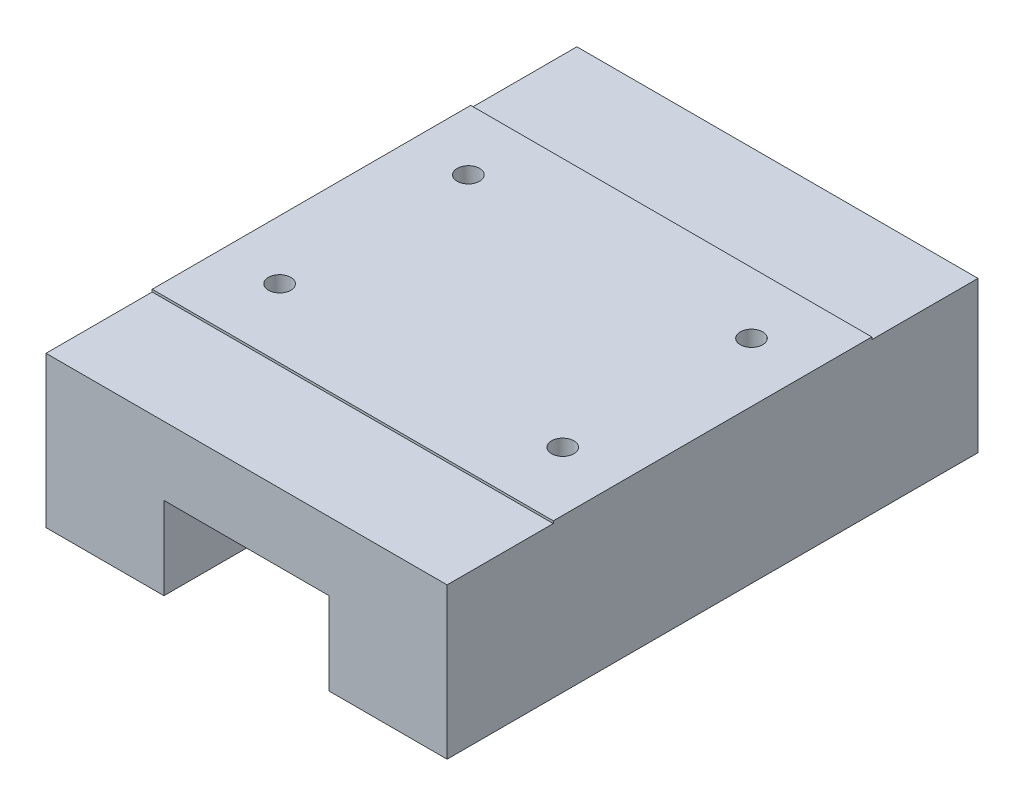
ISO-10303-21;
HEADER;
FILE_DESCRIPTION(('STEP AP214'),'2;1');
FILE_NAME('part.step','',(''),(''),'','','');
FILE_SCHEMA(('AUTOMOTIVE_DESIGN { 1 0 10303 214 1 1 1 1 }'));
ENDSEC;
DATA;
#1=APPLICATION_CONTEXT('core data for automotive mechanical design processes');
#2=APPLICATION_PROTOCOL_DEFINITION('international standard','automotive_design',2000,#1);
#3=PRODUCT_CONTEXT('',#1,'mechanical');
#4=PRODUCT('Part','Part','',(#3));
#5=PRODUCT_RELATED_PRODUCT_CATEGORY('part','',(#4));
#6=PRODUCT_DEFINITION_FORMATION('','',#4);
#7=PRODUCT_DEFINITION_CONTEXT('part definition',#1,'design');
#8=PRODUCT_DEFINITION('design','',#6,#7);
#9=PRODUCT_DEFINITION_SHAPE('','',#8);
#10=(LENGTH_UNIT() NAMED_UNIT(*) SI_UNIT(.MILLI.,.METRE.));
#11=(NAMED_UNIT(*) PLANE_ANGLE_UNIT() SI_UNIT($,.RADIAN.));
#12=(NAMED_UNIT(*) SI_UNIT($,.STERADIAN.) SOLID_ANGLE_UNIT());
#13=UNCERTAINTY_MEASURE_WITH_UNIT(LENGTH_MEASURE(1.E-05),#10,'distance_accuracy_value','');
#14=(GEOMETRIC_REPRESENTATION_CONTEXT(3) GLOBAL_UNCERTAINTY_ASSIGNED_CONTEXT((#13)) GLOBAL_UNIT_ASSIGNED_CONTEXT((#10,
#11,#12)) REPRESENTATION_CONTEXT('',''));
#15=CARTESIAN_POINT('',(0.,0.,0.));
#16=DIRECTION('',(0.,0.,1.));
#17=DIRECTION('',(1.,0.,0.));
#18=AXIS2_PLACEMENT_3D('',#15,#16,#17);
#19=CARTESIAN_POINT('',(0.,0.,13.5));
#20=DIRECTION('',(0.,1.,0.));
#21=DIRECTION('',(0.,0.,1.));
#22=AXIS2_PLACEMENT_3D('',#19,#20,#21);
#23=PLANE('',#22);
#24=DIRECTION('',(1.,0.,0.));
#25=VECTOR('',#24,1.);
#26=CARTESIAN_POINT('',(0.,0.,-4.5));
#27=LINE('',#26,#25);
#28=CARTESIAN_POINT('',(0.,0.,-4.5));
#29=VERTEX_POINT('',#28);
#30=CARTESIAN_POINT('',(5.,0.,-4.5));
#31=VERTEX_POINT('',#30);
#32=EDGE_CURVE('E162',#29,#31,#27,.T.);
#33=ORIENTED_EDGE('',*,*,#32,.T.);
#34=DIRECTION('',(0.,0.,1.));
#35=VECTOR('',#34,1.);
#36=CARTESIAN_POINT('',(5.,0.,-4.5));
#37=LINE('',#36,#35);
#38=CARTESIAN_POINT('',(5.,0.,18.));
#39=VERTEX_POINT('',#38);
#40=EDGE_CURVE('E145',#31,#39,#37,.T.);
#41=ORIENTED_EDGE('',*,*,#40,.T.);
#42=DIRECTION('',(1.,0.,0.));
#43=VECTOR('',#42,1.);
#44=CARTESIAN_POINT('',(0.,0.,18.));
#45=LINE('',#44,#43);
#46=CARTESIAN_POINT('',(0.,0.,18.));
#47=VERTEX_POINT('',#46);
#48=EDGE_CURVE('E253',#47,#39,#45,.T.);
#49=ORIENTED_EDGE('',*,*,#48,.F.);
#50=DIRECTION('',(0.,0.,-1.));
#51=VECTOR('',#50,1.);
#52=CARTESIAN_POINT('',(0.,0.,13.5));
#53=LINE('',#52,#51);
#54=EDGE_CURVE('E52',#47,#29,#53,.T.);
#55=ORIENTED_EDGE('',*,*,#54,.T.);
#56=EDGE_LOOP('',(#33,#41,#49,#55));
#57=FACE_BOUND('',#56,.T.);
#58=ADVANCED_FACE('F43',(#57),#23,.F.);
#59=CARTESIAN_POINT('',(0.,0.,13.5));
#60=DIRECTION('',(1.,0.,0.));
#61=DIRECTION('',(0.,0.,-1.));
#62=AXIS2_PLACEMENT_3D('',#59,#60,#61);
#63=PLANE('',#62);
#64=DIRECTION('',(0.,-1.,0.));
#65=VECTOR('',#64,1.);
#66=CARTESIAN_POINT('',(0.,0.,0.));
#67=LINE('',#66,#65);
#68=CARTESIAN_POINT('',(0.,6.5,0.));
#69=VERTEX_POINT('',#68);
#70=CARTESIAN_POINT('',(0.,6.4,0.));
#71=VERTEX_POINT('',#70);
#72=EDGE_CURVE('E191',#69,#71,#67,.T.);
#73=ORIENTED_EDGE('',*,*,#72,.T.);
#74=DIRECTION('',(0.,0.,1.));
#75=VECTOR('',#74,1.);
#76=CARTESIAN_POINT('',(0.,6.4,-4.5));
#77=LINE('',#76,#75);
#78=CARTESIAN_POINT('',(0.,6.4,-4.5));
#79=VERTEX_POINT('',#78);
#80=EDGE_CURVE('E183',#79,#71,#77,.T.);
#81=ORIENTED_EDGE('',*,*,#80,.F.);
#82=DIRECTION('',(0.,-1.,0.));
#83=VECTOR('',#82,1.);
#84=CARTESIAN_POINT('',(0.,0.,-4.5));
#85=LINE('',#84,#83);
#86=EDGE_CURVE('E175',#79,#29,#85,.T.);
#87=ORIENTED_EDGE('',*,*,#86,.T.);
#88=ORIENTED_EDGE('',*,*,#54,.F.);
#89=DIRECTION('',(0.,-1.,0.));
#90=VECTOR('',#89,1.);
#91=CARTESIAN_POINT('',(0.,0.,18.));
#92=LINE('',#91,#90);
#93=CARTESIAN_POINT('',(0.,6.4,18.));
#94=VERTEX_POINT('',#93);
#95=EDGE_CURVE('E258',#94,#47,#92,.T.);
#96=ORIENTED_EDGE('',*,*,#95,.F.);
#97=CARTESIAN_POINT('',(0.,6.4,13.5));
#98=VERTEX_POINT('',#97);
#99=EDGE_CURVE('E185',#98,#94,#77,.T.);
#100=ORIENTED_EDGE('',*,*,#99,.F.);
#101=DIRECTION('',(0.,-1.,0.));
#102=VECTOR('',#101,1.);
#103=CARTESIAN_POINT('',(0.,0.,13.5));
#104=LINE('',#103,#102);
#105=CARTESIAN_POINT('',(0.,6.5,13.5));
#106=VERTEX_POINT('',#105);
#107=EDGE_CURVE('E192',#106,#98,#104,.T.);
#108=ORIENTED_EDGE('',*,*,#107,.F.);
#109=DIRECTION('',(0.,0.,-1.));
#110=VECTOR('',#109,1.);
#111=CARTESIAN_POINT('',(0.,6.5,13.5));
#112=LINE('',#111,#110);
#113=EDGE_CURVE('E200',#106,#69,#112,.T.);
#114=ORIENTED_EDGE('',*,*,#113,.T.);
#115=EDGE_LOOP('',(#73,#81,#87,#88,#96,#100,#108,#114));
#116=FACE_BOUND('',#115,.T.);
#117=ADVANCED_FACE('F45',(#116),#63,.F.);
#118=CARTESIAN_POINT('',(12.,0.,18.));
#119=VERTEX_POINT('',#118);
#120=CARTESIAN_POINT('',(17.,0.,18.));
#121=VERTEX_POINT('',#120);
#122=EDGE_CURVE('E252',#119,#121,#45,.T.);
#123=ORIENTED_EDGE('',*,*,#122,.F.);
#124=DIRECTION('',(0.,0.,1.));
#125=VECTOR('',#124,1.);
#126=CARTESIAN_POINT('',(12.,0.,-4.5));
#127=LINE('',#126,#125);
#128=CARTESIAN_POINT('',(12.,0.,-4.5));
#129=VERTEX_POINT('',#128);
#130=EDGE_CURVE('E59',#129,#119,#127,.T.);
#131=ORIENTED_EDGE('',*,*,#130,.F.);
#132=CARTESIAN_POINT('',(17.,0.,-4.5));
#133=VERTEX_POINT('',#132);
#134=EDGE_CURVE('E170',#129,#133,#27,.T.);
#135=ORIENTED_EDGE('',*,*,#134,.T.);
#136=DIRECTION('',(0.,0.,-1.));
#137=VECTOR('',#136,1.);
#138=CARTESIAN_POINT('',(17.,0.,13.5));
#139=LINE('',#138,#137);
#140=EDGE_CURVE('E212',#121,#133,#139,.T.);
#141=ORIENTED_EDGE('',*,*,#140,.F.);
#142=EDGE_LOOP('',(#123,#131,#135,#141));
#143=FACE_BOUND('',#142,.T.);
#144=ADVANCED_FACE('F297',(#143),#23,.F.);
#145=CARTESIAN_POINT('',(17.,0.,13.5));
#146=DIRECTION('',(-1.,0.,0.));
#147=DIRECTION('',(0.,0.,1.));
#148=AXIS2_PLACEMENT_3D('',#145,#146,#147);
#149=PLANE('',#148);
#150=DIRECTION('',(0.,1.,0.));
#151=VECTOR('',#150,1.);
#152=CARTESIAN_POINT('',(17.,0.,13.5));
#153=LINE('',#152,#151);
#154=CARTESIAN_POINT('',(17.,6.4,13.5));
#155=VERTEX_POINT('',#154);
#156=CARTESIAN_POINT('',(17.,6.5,13.5));
#157=VERTEX_POINT('',#156);
#158=EDGE_CURVE('E194',#155,#157,#153,.T.);
#159=ORIENTED_EDGE('',*,*,#158,.F.);
#160=DIRECTION('',(0.,0.,1.));
#161=VECTOR('',#160,1.);
#162=CARTESIAN_POINT('',(17.,6.4,-4.5));
#163=LINE('',#162,#161);
#164=CARTESIAN_POINT('',(17.,6.4,18.));
#165=VERTEX_POINT('',#164);
#166=EDGE_CURVE('E182',#155,#165,#163,.T.);
#167=ORIENTED_EDGE('',*,*,#166,.T.);
#168=DIRECTION('',(0.,1.,0.));
#169=VECTOR('',#168,1.);
#170=CARTESIAN_POINT('',(17.,0.,18.));
#171=LINE('',#170,#169);
#172=EDGE_CURVE('E221',#121,#165,#171,.T.);
#173=ORIENTED_EDGE('',*,*,#172,.F.);
#174=ORIENTED_EDGE('',*,*,#140,.T.);
#175=DIRECTION('',(0.,1.,0.));
#176=VECTOR('',#175,1.);
#177=CARTESIAN_POINT('',(17.,0.,-4.5));
#178=LINE('',#177,#176);
#179=CARTESIAN_POINT('',(17.,6.4,-4.5));
#180=VERTEX_POINT('',#179);
#181=EDGE_CURVE('E169',#133,#180,#178,.T.);
#182=ORIENTED_EDGE('',*,*,#181,.T.);
#183=CARTESIAN_POINT('',(17.,6.4,0.));
#184=VERTEX_POINT('',#183);
#185=EDGE_CURVE('E186',#180,#184,#163,.T.);
#186=ORIENTED_EDGE('',*,*,#185,.T.);
#187=DIRECTION('',(0.,1.,0.));
#188=VECTOR('',#187,1.);
#189=CARTESIAN_POINT('',(17.,0.,0.));
#190=LINE('',#189,#188);
#191=CARTESIAN_POINT('',(17.,6.5,0.));
#192=VERTEX_POINT('',#191);
#193=EDGE_CURVE('E203',#184,#192,#190,.T.);
#194=ORIENTED_EDGE('',*,*,#193,.T.);
#195=DIRECTION('',(0.,0.,-1.));
#196=VECTOR('',#195,1.);
#197=CARTESIAN_POINT('',(17.,6.5,13.5));
#198=LINE('',#197,#196);
#199=EDGE_CURVE('E209',#157,#192,#198,.T.);
#200=ORIENTED_EDGE('',*,*,#199,.F.);
#201=EDGE_LOOP('',(#159,#167,#173,#174,#182,#186,#194,#200));
#202=FACE_BOUND('',#201,.T.);
#203=ADVANCED_FACE('F218',(#202),#149,.F.);
#204=CARTESIAN_POINT('',(0.,6.5,13.5));
#205=DIRECTION('',(0.,-1.,0.));
#206=DIRECTION('',(0.,0.,-1.));
#207=AXIS2_PLACEMENT_3D('',#204,#205,#206);
#208=PLANE('',#207);
#209=CARTESIAN_POINT('',(2.5,6.5,10.6));
#210=DIRECTION('',(0.,1.,0.));
#211=DIRECTION('',(0.,0.,1.));
#212=AXIS2_PLACEMENT_3D('',#209,#210,#211);
#213=CIRCLE('',#212,0.474999999999989);
#214=CARTESIAN_POINT('',(2.5,6.5,11.075));
#215=VERTEX_POINT('',#214);
#216=EDGE_CURVE('E281',#215,#215,#213,.T.);
#217=ORIENTED_EDGE('',*,*,#216,.F.);
#218=EDGE_LOOP('',(#217));
#219=FACE_BOUND('',#218,.T.);
#220=CARTESIAN_POINT('',(14.5,6.5,10.6));
#221=DIRECTION('',(0.,1.,0.));
#222=DIRECTION('',(0.,0.,1.));
#223=AXIS2_PLACEMENT_3D('',#220,#221,#222);
#224=CIRCLE('',#223,0.474999999999989);
#225=CARTESIAN_POINT('',(14.5,6.5,11.075));
#226=VERTEX_POINT('',#225);
#227=EDGE_CURVE('E275',#226,#226,#224,.T.);
#228=ORIENTED_EDGE('',*,*,#227,.F.);
#229=EDGE_LOOP('',(#228));
#230=FACE_BOUND('',#229,.T.);
#231=CARTESIAN_POINT('',(14.5,6.5,2.6));
#232=DIRECTION('',(0.,1.,0.));
#233=DIRECTION('',(0.,0.,1.));
#234=AXIS2_PLACEMENT_3D('',#231,#232,#233);
#235=CIRCLE('',#234,0.474999999999989);
#236=CARTESIAN_POINT('',(14.5,6.5,3.07499999999999));
#237=VERTEX_POINT('',#236);
#238=EDGE_CURVE('E269',#237,#237,#235,.T.);
#239=ORIENTED_EDGE('',*,*,#238,.F.);
#240=EDGE_LOOP('',(#239));
#241=FACE_BOUND('',#240,.T.);
#242=CARTESIAN_POINT('',(2.49999999999997,6.5,2.6));
#243=DIRECTION('',(0.,1.,0.));
#244=DIRECTION('',(0.,0.,1.));
#245=AXIS2_PLACEMENT_3D('',#242,#243,#244);
#246=CIRCLE('',#245,0.474999999999989);
#247=CARTESIAN_POINT('',(2.49999999999997,6.5,3.07499999999999));
#248=VERTEX_POINT('',#247);
#249=EDGE_CURVE('E263',#248,#248,#246,.T.);
#250=ORIENTED_EDGE('',*,*,#249,.F.);
#251=EDGE_LOOP('',(#250));
#252=FACE_BOUND('',#251,.T.);
#253=DIRECTION('',(-1.,0.,0.));
#254=VECTOR('',#253,1.);
#255=CARTESIAN_POINT('',(0.,6.5,0.));
#256=LINE('',#255,#254);
#257=EDGE_CURVE('E195',#192,#69,#256,.T.);
#258=ORIENTED_EDGE('',*,*,#257,.T.);
#259=ORIENTED_EDGE('',*,*,#113,.F.);
#260=DIRECTION('',(-1.,0.,0.));
#261=VECTOR('',#260,1.);
#262=CARTESIAN_POINT('',(0.,6.5,13.5));
#263=LINE('',#262,#261);
#264=EDGE_CURVE('E197',#157,#106,#263,.T.);
#265=ORIENTED_EDGE('',*,*,#264,.F.);
#266=ORIENTED_EDGE('',*,*,#199,.T.);
#267=EDGE_LOOP('',(#258,#259,#265,#266));
#268=FACE_BOUND('',#267,.T.);
#269=ADVANCED_FACE('F236',(#219,#230,#241,#252,#268),#208,.F.);
#270=CARTESIAN_POINT('',(0.,0.,13.5));
#271=DIRECTION('',(0.,0.,-1.));
#272=DIRECTION('',(-1.,0.,0.));
#273=AXIS2_PLACEMENT_3D('',#270,#271,#272);
#274=PLANE('',#273);
#275=ORIENTED_EDGE('',*,*,#107,.T.);
#276=DIRECTION('',(1.,0.,0.));
#277=VECTOR('',#276,1.);
#278=CARTESIAN_POINT('',(0.,6.4,13.5));
#279=LINE('',#278,#277);
#280=EDGE_CURVE('E67',#98,#155,#279,.T.);
#281=ORIENTED_EDGE('',*,*,#280,.T.);
#282=ORIENTED_EDGE('',*,*,#158,.T.);
#283=ORIENTED_EDGE('',*,*,#264,.T.);
#284=EDGE_LOOP('',(#275,#281,#282,#283));
#285=FACE_BOUND('',#284,.T.);
#286=ADVANCED_FACE('F242',(#285),#274,.F.);
#287=CARTESIAN_POINT('',(0.,0.,0.));
#288=DIRECTION('',(0.,0.,-1.));
#289=DIRECTION('',(-1.,0.,0.));
#290=AXIS2_PLACEMENT_3D('',#287,#288,#289);
#291=PLANE('',#290);
#292=DIRECTION('',(1.,0.,0.));
#293=VECTOR('',#292,1.);
#294=CARTESIAN_POINT('',(0.,6.4,0.));
#295=LINE('',#294,#293);
#296=EDGE_CURVE('E11',#71,#184,#295,.T.);
#297=ORIENTED_EDGE('',*,*,#296,.F.);
#298=ORIENTED_EDGE('',*,*,#72,.F.);
#299=ORIENTED_EDGE('',*,*,#257,.F.);
#300=ORIENTED_EDGE('',*,*,#193,.F.);
#301=EDGE_LOOP('',(#297,#298,#299,#300));
#302=FACE_BOUND('',#301,.T.);
#303=ADVANCED_FACE('F232',(#302),#291,.T.);
#304=CARTESIAN_POINT('',(0.,0.,-4.5));
#305=DIRECTION('',(0.,0.,-1.));
#306=DIRECTION('',(-1.,0.,0.));
#307=AXIS2_PLACEMENT_3D('',#304,#305,#306);
#308=PLANE('',#307);
#309=DIRECTION('',(0.,-1.,0.));
#310=VECTOR('',#309,1.);
#311=CARTESIAN_POINT('',(5.,3.5,-4.5));
#312=LINE('',#311,#310);
#313=CARTESIAN_POINT('',(5.,3.5,-4.5));
#314=VERTEX_POINT('',#313);
#315=EDGE_CURVE('E148',#314,#31,#312,.T.);
#316=ORIENTED_EDGE('',*,*,#315,.T.);
#317=ORIENTED_EDGE('',*,*,#32,.F.);
#318=ORIENTED_EDGE('',*,*,#86,.F.);
#319=DIRECTION('',(-1.,0.,0.));
#320=VECTOR('',#319,1.);
#321=CARTESIAN_POINT('',(0.,6.4,-4.5));
#322=LINE('',#321,#320);
#323=EDGE_CURVE('E173',#180,#79,#322,.T.);
#324=ORIENTED_EDGE('',*,*,#323,.F.);
#325=ORIENTED_EDGE('',*,*,#181,.F.);
#326=ORIENTED_EDGE('',*,*,#134,.F.);
#327=DIRECTION('',(0.,1.,0.));
#328=VECTOR('',#327,1.);
#329=CARTESIAN_POINT('',(12.,3.5,-4.5));
#330=LINE('',#329,#328);
#331=CARTESIAN_POINT('',(12.,3.5,-4.5));
#332=VERTEX_POINT('',#331);
#333=EDGE_CURVE('E166',#129,#332,#330,.T.);
#334=ORIENTED_EDGE('',*,*,#333,.T.);
#335=DIRECTION('',(-1.,0.,0.));
#336=VECTOR('',#335,1.);
#337=CARTESIAN_POINT('',(5.,3.5,-4.5));
#338=LINE('',#337,#336);
#339=EDGE_CURVE('E156',#332,#314,#338,.T.);
#340=ORIENTED_EDGE('',*,*,#339,.T.);
#341=EDGE_LOOP('',(#316,#317,#318,#324,#325,#326,#334,#340));
#342=FACE_BOUND('',#341,.T.);
#343=ADVANCED_FACE('F160',(#342),#308,.T.);
#344=CARTESIAN_POINT('',(0.,6.4,-4.5));
#345=DIRECTION('',(0.,1.,0.));
#346=DIRECTION('',(0.,0.,1.));
#347=AXIS2_PLACEMENT_3D('',#344,#345,#346);
#348=PLANE('',#347);
#349=ORIENTED_EDGE('',*,*,#80,.T.);
#350=ORIENTED_EDGE('',*,*,#296,.T.);
#351=ORIENTED_EDGE('',*,*,#185,.F.);
#352=ORIENTED_EDGE('',*,*,#323,.T.);
#353=EDGE_LOOP('',(#349,#350,#351,#352));
#354=FACE_BOUND('',#353,.T.);
#355=ADVANCED_FACE('F226',(#354),#348,.T.);
#356=ORIENTED_EDGE('',*,*,#280,.F.);
#357=ORIENTED_EDGE('',*,*,#99,.T.);
#358=DIRECTION('',(-1.,0.,0.));
#359=VECTOR('',#358,1.);
#360=CARTESIAN_POINT('',(0.,6.4,18.));
#361=LINE('',#360,#359);
#362=EDGE_CURVE('E248',#165,#94,#361,.T.);
#363=ORIENTED_EDGE('',*,*,#362,.F.);
#364=ORIENTED_EDGE('',*,*,#166,.F.);
#365=EDGE_LOOP('',(#356,#357,#363,#364));
#366=FACE_BOUND('',#365,.T.);
#367=ADVANCED_FACE('F245',(#366),#348,.T.);
#368=CARTESIAN_POINT('',(0.,0.,18.));
#369=DIRECTION('',(0.,0.,-1.));
#370=DIRECTION('',(-1.,0.,0.));
#371=AXIS2_PLACEMENT_3D('',#368,#369,#370);
#372=PLANE('',#371);
#373=ORIENTED_EDGE('',*,*,#48,.T.);
#374=DIRECTION('',(0.,-1.,0.));
#375=VECTOR('',#374,1.);
#376=CARTESIAN_POINT('',(5.,3.5,18.));
#377=LINE('',#376,#375);
#378=CARTESIAN_POINT('',(5.,3.5,18.));
#379=VERTEX_POINT('',#378);
#380=EDGE_CURVE('E151',#379,#39,#377,.T.);
#381=ORIENTED_EDGE('',*,*,#380,.F.);
#382=DIRECTION('',(-1.,0.,0.));
#383=VECTOR('',#382,1.);
#384=CARTESIAN_POINT('',(5.,3.5,18.));
#385=LINE('',#384,#383);
#386=CARTESIAN_POINT('',(12.,3.5,18.));
#387=VERTEX_POINT('',#386);
#388=EDGE_CURVE('E167',#387,#379,#385,.T.);
#389=ORIENTED_EDGE('',*,*,#388,.F.);
#390=DIRECTION('',(0.,1.,0.));
#391=VECTOR('',#390,1.);
#392=CARTESIAN_POINT('',(12.,3.5,18.));
#393=LINE('',#392,#391);
#394=EDGE_CURVE('E291',#119,#387,#393,.T.);
#395=ORIENTED_EDGE('',*,*,#394,.F.);
#396=ORIENTED_EDGE('',*,*,#122,.T.);
#397=ORIENTED_EDGE('',*,*,#172,.T.);
#398=ORIENTED_EDGE('',*,*,#362,.T.);
#399=ORIENTED_EDGE('',*,*,#95,.T.);
#400=EDGE_LOOP('',(#373,#381,#389,#395,#396,#397,#398,#399));
#401=FACE_BOUND('',#400,.T.);
#402=ADVANCED_FACE('F250',(#401),#372,.F.);
#403=CARTESIAN_POINT('',(2.49999999999997,2.85,2.6));
#404=DIRECTION('',(0.,1.,0.));
#405=DIRECTION('',(0.,0.,1.));
#406=AXIS2_PLACEMENT_3D('',#403,#404,#405);
#407=CONICAL_SURFACE('',#406,0.474999999999988,1.02974425867665);
#408=CARTESIAN_POINT('',(2.49999999999997,2.56459120596191,2.6));
#409=VERTEX_POINT('',#408);
#410=VERTEX_LOOP('',#409);
#411=FACE_BOUND('',#410,.T.);
#412=CARTESIAN_POINT('',(2.49999999999997,2.85,2.6));
#413=DIRECTION('',(0.,1.,0.));
#414=DIRECTION('',(0.,0.,1.));
#415=AXIS2_PLACEMENT_3D('',#412,#413,#414);
#416=CIRCLE('',#415,0.474999999999988);
#417=CARTESIAN_POINT('',(2.49999999999997,2.85,3.07499999999999));
#418=VERTEX_POINT('',#417);
#419=EDGE_CURVE('E260',#418,#418,#416,.T.);
#420=ORIENTED_EDGE('',*,*,#419,.T.);
#421=EDGE_LOOP('',(#420));
#422=FACE_BOUND('',#421,.T.);
#423=ADVANCED_FACE('F377',(#411,#422),#407,.F.);
#424=CARTESIAN_POINT('',(2.49999999999997,6.5,2.6));
#425=DIRECTION('',(0.,1.,0.));
#426=DIRECTION('',(0.,0.,1.));
#427=AXIS2_PLACEMENT_3D('',#424,#425,#426);
#428=CYLINDRICAL_SURFACE('',#427,0.474999999999989);
#429=ORIENTED_EDGE('',*,*,#419,.F.);
#430=EDGE_LOOP('',(#429));
#431=FACE_BOUND('',#430,.T.);
#432=ORIENTED_EDGE('',*,*,#249,.T.);
#433=EDGE_LOOP('',(#432));
#434=FACE_BOUND('',#433,.T.);
#435=ADVANCED_FACE('F382',(#431,#434),#428,.F.);
#436=CARTESIAN_POINT('',(14.5,2.85,2.6));
#437=DIRECTION('',(0.,1.,0.));
#438=DIRECTION('',(0.,0.,1.));
#439=AXIS2_PLACEMENT_3D('',#436,#437,#438);
#440=CONICAL_SURFACE('',#439,0.474999999999988,1.02974425867665);
#441=CARTESIAN_POINT('',(14.5,2.56459120596191,2.6));
#442=VERTEX_POINT('',#441);
#443=VERTEX_LOOP('',#442);
#444=FACE_BOUND('',#443,.T.);
#445=CARTESIAN_POINT('',(14.5,2.85,2.6));
#446=DIRECTION('',(0.,1.,0.));
#447=DIRECTION('',(0.,0.,1.));
#448=AXIS2_PLACEMENT_3D('',#445,#446,#447);
#449=CIRCLE('',#448,0.474999999999988);
#450=CARTESIAN_POINT('',(14.5,2.85,3.07499999999999));
#451=VERTEX_POINT('',#450);
#452=EDGE_CURVE('E266',#451,#451,#449,.T.);
#453=ORIENTED_EDGE('',*,*,#452,.T.);
#454=EDGE_LOOP('',(#453));
#455=FACE_BOUND('',#454,.T.);
#456=ADVANCED_FACE('F393',(#444,#455),#440,.F.);
#457=CARTESIAN_POINT('',(14.5,6.5,2.6));
#458=DIRECTION('',(0.,1.,0.));
#459=DIRECTION('',(0.,0.,1.));
#460=AXIS2_PLACEMENT_3D('',#457,#458,#459);
#461=CYLINDRICAL_SURFACE('',#460,0.474999999999988);
#462=ORIENTED_EDGE('',*,*,#452,.F.);
#463=EDGE_LOOP('',(#462));
#464=FACE_BOUND('',#463,.T.);
#465=ORIENTED_EDGE('',*,*,#238,.T.);
#466=EDGE_LOOP('',(#465));
#467=FACE_BOUND('',#466,.T.);
#468=ADVANCED_FACE('F405',(#464,#467),#461,.F.);
#469=CARTESIAN_POINT('',(14.5,2.85,10.6));
#470=DIRECTION('',(0.,1.,0.));
#471=DIRECTION('',(0.,0.,1.));
#472=AXIS2_PLACEMENT_3D('',#469,#470,#471);
#473=CONICAL_SURFACE('',#472,0.474999999999988,1.02974425867665);
#474=CARTESIAN_POINT('',(14.5,2.56459120596191,10.6));
#475=VERTEX_POINT('',#474);
#476=VERTEX_LOOP('',#475);
#477=FACE_BOUND('',#476,.T.);
#478=CARTESIAN_POINT('',(14.5,2.85,10.6));
#479=DIRECTION('',(0.,1.,0.));
#480=DIRECTION('',(0.,0.,1.));
#481=AXIS2_PLACEMENT_3D('',#478,#479,#480);
#482=CIRCLE('',#481,0.474999999999988);
#483=CARTESIAN_POINT('',(14.5,2.85,11.075));
#484=VERTEX_POINT('',#483);
#485=EDGE_CURVE('E272',#484,#484,#482,.T.);
#486=ORIENTED_EDGE('',*,*,#485,.T.);
#487=EDGE_LOOP('',(#486));
#488=FACE_BOUND('',#487,.T.);
#489=ADVANCED_FACE('F415',(#477,#488),#473,.F.);
#490=CARTESIAN_POINT('',(14.5,6.5,10.6));
#491=DIRECTION('',(0.,1.,0.));
#492=DIRECTION('',(0.,0.,1.));
#493=AXIS2_PLACEMENT_3D('',#490,#491,#492);
#494=CYLINDRICAL_SURFACE('',#493,0.474999999999988);
#495=ORIENTED_EDGE('',*,*,#485,.F.);
#496=EDGE_LOOP('',(#495));
#497=FACE_BOUND('',#496,.T.);
#498=ORIENTED_EDGE('',*,*,#227,.T.);
#499=EDGE_LOOP('',(#498));
#500=FACE_BOUND('',#499,.T.);
#501=ADVANCED_FACE('F427',(#497,#500),#494,.F.);
#502=CARTESIAN_POINT('',(2.5,2.85,10.6));
#503=DIRECTION('',(0.,1.,0.));
#504=DIRECTION('',(0.,0.,1.));
#505=AXIS2_PLACEMENT_3D('',#502,#503,#504);
#506=CONICAL_SURFACE('',#505,0.474999999999988,1.02974425867665);
#507=CARTESIAN_POINT('',(2.5,2.56459120596191,10.6));
#508=VERTEX_POINT('',#507);
#509=VERTEX_LOOP('',#508);
#510=FACE_BOUND('',#509,.T.);
#511=CARTESIAN_POINT('',(2.5,2.85,10.6));
#512=DIRECTION('',(0.,1.,0.));
#513=DIRECTION('',(0.,0.,1.));
#514=AXIS2_PLACEMENT_3D('',#511,#512,#513);
#515=CIRCLE('',#514,0.474999999999988);
#516=CARTESIAN_POINT('',(2.5,2.85,11.075));
#517=VERTEX_POINT('',#516);
#518=EDGE_CURVE('E278',#517,#517,#515,.T.);
#519=ORIENTED_EDGE('',*,*,#518,.T.);
#520=EDGE_LOOP('',(#519));
#521=FACE_BOUND('',#520,.T.);
#522=ADVANCED_FACE('F437',(#510,#521),#506,.F.);
#523=CARTESIAN_POINT('',(2.5,6.5,10.6));
#524=DIRECTION('',(0.,1.,0.));
#525=DIRECTION('',(0.,0.,1.));
#526=AXIS2_PLACEMENT_3D('',#523,#524,#525);
#527=CYLINDRICAL_SURFACE('',#526,0.474999999999989);
#528=ORIENTED_EDGE('',*,*,#518,.F.);
#529=EDGE_LOOP('',(#528));
#530=FACE_BOUND('',#529,.T.);
#531=ORIENTED_EDGE('',*,*,#216,.T.);
#532=EDGE_LOOP('',(#531));
#533=FACE_BOUND('',#532,.T.);
#534=ADVANCED_FACE('F448',(#530,#533),#527,.F.);
#535=CARTESIAN_POINT('',(5.,3.5,-4.5));
#536=DIRECTION('',(-1.,0.,0.));
#537=DIRECTION('',(0.,-1.,0.));
#538=AXIS2_PLACEMENT_3D('',#535,#536,#537);
#539=PLANE('',#538);
#540=ORIENTED_EDGE('',*,*,#380,.T.);
#541=ORIENTED_EDGE('',*,*,#40,.F.);
#542=ORIENTED_EDGE('',*,*,#315,.F.);
#543=DIRECTION('',(0.,0.,1.));
#544=VECTOR('',#543,1.);
#545=CARTESIAN_POINT('',(5.,3.5,-4.5));
#546=LINE('',#545,#544);
#547=EDGE_CURVE('E283',#314,#379,#546,.T.);
#548=ORIENTED_EDGE('',*,*,#547,.T.);
#549=EDGE_LOOP('',(#540,#541,#542,#548));
#550=FACE_BOUND('',#549,.T.);
#551=ADVANCED_FACE('F147',(#550),#539,.F.);
#552=CARTESIAN_POINT('',(5.,3.5,-4.5));
#553=DIRECTION('',(0.,1.,0.));
#554=DIRECTION('',(0.,0.,1.));
#555=AXIS2_PLACEMENT_3D('',#552,#553,#554);
#556=PLANE('',#555);
#557=ORIENTED_EDGE('',*,*,#388,.T.);
#558=ORIENTED_EDGE('',*,*,#547,.F.);
#559=ORIENTED_EDGE('',*,*,#339,.F.);
#560=DIRECTION('',(0.,0.,1.));
#561=VECTOR('',#560,1.);
#562=CARTESIAN_POINT('',(12.,3.5,-4.5));
#563=LINE('',#562,#561);
#564=EDGE_CURVE('E286',#332,#387,#563,.T.);
#565=ORIENTED_EDGE('',*,*,#564,.T.);
#566=EDGE_LOOP('',(#557,#558,#559,#565));
#567=FACE_BOUND('',#566,.T.);
#568=ADVANCED_FACE('F494',(#567),#556,.F.);
#569=CARTESIAN_POINT('',(12.,3.5,-4.5));
#570=DIRECTION('',(1.,0.,0.));
#571=DIRECTION('',(0.,1.,0.));
#572=AXIS2_PLACEMENT_3D('',#569,#570,#571);
#573=PLANE('',#572);
#574=ORIENTED_EDGE('',*,*,#394,.T.);
#575=ORIENTED_EDGE('',*,*,#564,.F.);
#576=ORIENTED_EDGE('',*,*,#333,.F.);
#577=ORIENTED_EDGE('',*,*,#130,.T.);
#578=EDGE_LOOP('',(#574,#575,#576,#577));
#579=FACE_BOUND('',#578,.T.);
#580=ADVANCED_FACE('F296',(#579),#573,.F.);
#581=CLOSED_SHELL('',(#58,#117,#144,#203,#269,#286,#303,#343,#355,#367,#402,#423,#435,#456,#468,
#489,#501,#522,#534,#551,#568,#580));
#582=MANIFOLD_SOLID_BREP('B2',#581);
#583=ADVANCED_BREP_SHAPE_REPRESENTATION('',(#18,#582),#14);
#584=SHAPE_DEFINITION_REPRESENTATION(#9,#583);
ENDSEC;
END-ISO-10303-21;
